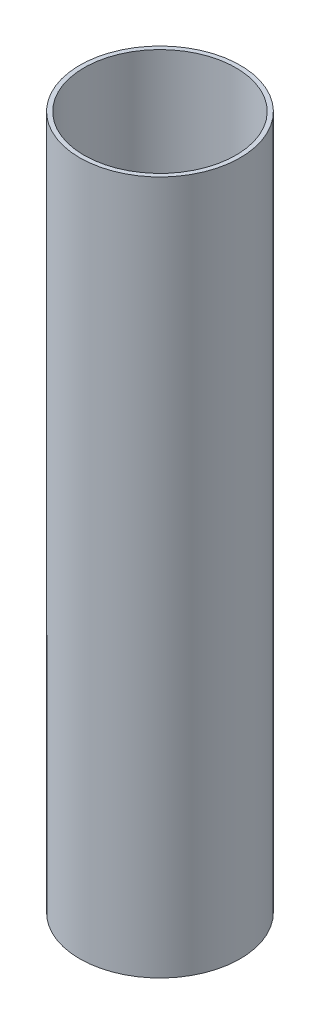
ISO-10303-21;
HEADER;
FILE_DESCRIPTION(('STEP AP214'),'2;1');
FILE_NAME('part.step','',(''),(''),'','','');
FILE_SCHEMA(('AUTOMOTIVE_DESIGN { 1 0 10303 214 1 1 1 1 }'));
ENDSEC;
DATA;
#1=APPLICATION_CONTEXT('core data for automotive mechanical design processes');
#2=APPLICATION_PROTOCOL_DEFINITION('international standard','automotive_design',2000,#1);
#3=PRODUCT_CONTEXT('',#1,'mechanical');
#4=PRODUCT('Part','Part','',(#3));
#5=PRODUCT_RELATED_PRODUCT_CATEGORY('part','',(#4));
#6=PRODUCT_DEFINITION_FORMATION('','',#4);
#7=PRODUCT_DEFINITION_CONTEXT('part definition',#1,'design');
#8=PRODUCT_DEFINITION('design','',#6,#7);
#9=PRODUCT_DEFINITION_SHAPE('','',#8);
#10=(LENGTH_UNIT() NAMED_UNIT(*) SI_UNIT(.MILLI.,.METRE.));
#11=(NAMED_UNIT(*) PLANE_ANGLE_UNIT() SI_UNIT($,.RADIAN.));
#12=(NAMED_UNIT(*) SI_UNIT($,.STERADIAN.) SOLID_ANGLE_UNIT());
#13=UNCERTAINTY_MEASURE_WITH_UNIT(LENGTH_MEASURE(1.E-05),#10,'distance_accuracy_value','');
#14=(GEOMETRIC_REPRESENTATION_CONTEXT(3) GLOBAL_UNCERTAINTY_ASSIGNED_CONTEXT((#13)) GLOBAL_UNIT_ASSIGNED_CONTEXT((#10,
#11,#12)) REPRESENTATION_CONTEXT('',''));
#15=CARTESIAN_POINT('',(0.,0.,0.));
#16=DIRECTION('',(0.,0.,1.));
#17=DIRECTION('',(1.,0.,0.));
#18=AXIS2_PLACEMENT_3D('',#15,#16,#17);
#19=CARTESIAN_POINT('',(0.,508.,0.));
#20=DIRECTION('',(0.,1.,0.));
#21=DIRECTION('',(0.,0.,1.));
#22=AXIS2_PLACEMENT_3D('',#19,#20,#21);
#23=PLANE('',#22);
#24=CARTESIAN_POINT('',(0.,508.,0.));
#25=DIRECTION('',(0.,1.,0.));
#26=DIRECTION('',(0.,0.,1.));
#27=AXIS2_PLACEMENT_3D('',#24,#25,#26);
#28=CIRCLE('',#27,58.7375);
#29=CARTESIAN_POINT('',(0.,508.,58.7375));
#30=VERTEX_POINT('',#29);
#31=EDGE_CURVE('E10',#30,#30,#28,.T.);
#32=ORIENTED_EDGE('',*,*,#31,.T.);
#33=EDGE_LOOP('',(#32));
#34=FACE_BOUND('',#33,.T.);
#35=CARTESIAN_POINT('',(0.,508.,0.));
#36=DIRECTION('',(0.,1.,0.));
#37=DIRECTION('',(0.,0.,1.));
#38=AXIS2_PLACEMENT_3D('',#35,#36,#37);
#39=CIRCLE('',#38,55.5625);
#40=CARTESIAN_POINT('',(0.,508.,55.5625));
#41=VERTEX_POINT('',#40);
#42=EDGE_CURVE('E50',#41,#41,#39,.T.);
#43=ORIENTED_EDGE('',*,*,#42,.F.);
#44=EDGE_LOOP('',(#43));
#45=FACE_BOUND('',#44,.T.);
#46=ADVANCED_FACE('F37',(#34,#45),#23,.T.);
#47=CARTESIAN_POINT('',(0.,0.,0.));
#48=DIRECTION('',(0.,1.,0.));
#49=DIRECTION('',(0.,0.,1.));
#50=AXIS2_PLACEMENT_3D('',#47,#48,#49);
#51=PLANE('',#50);
#52=CARTESIAN_POINT('',(0.,0.,0.));
#53=DIRECTION('',(0.,1.,0.));
#54=DIRECTION('',(0.,0.,1.));
#55=AXIS2_PLACEMENT_3D('',#52,#53,#54);
#56=CIRCLE('',#55,58.7375);
#57=CARTESIAN_POINT('',(0.,0.,58.7375));
#58=VERTEX_POINT('',#57);
#59=EDGE_CURVE('E41',#58,#58,#56,.T.);
#60=ORIENTED_EDGE('',*,*,#59,.F.);
#61=EDGE_LOOP('',(#60));
#62=FACE_BOUND('',#61,.T.);
#63=CARTESIAN_POINT('',(0.,0.,0.));
#64=DIRECTION('',(0.,1.,0.));
#65=DIRECTION('',(0.,0.,1.));
#66=AXIS2_PLACEMENT_3D('',#63,#64,#65);
#67=CIRCLE('',#66,55.5625);
#68=CARTESIAN_POINT('',(0.,0.,55.5625));
#69=VERTEX_POINT('',#68);
#70=EDGE_CURVE('E52',#69,#69,#67,.T.);
#71=ORIENTED_EDGE('',*,*,#70,.T.);
#72=EDGE_LOOP('',(#71));
#73=FACE_BOUND('',#72,.T.);
#74=ADVANCED_FACE('F64',(#62,#73),#51,.F.);
#75=CARTESIAN_POINT('',(0.,508.,0.));
#76=DIRECTION('',(0.,-1.,0.));
#77=DIRECTION('',(0.,0.,-1.));
#78=AXIS2_PLACEMENT_3D('',#75,#76,#77);
#79=CYLINDRICAL_SURFACE('',#78,58.7375);
#80=ORIENTED_EDGE('',*,*,#31,.F.);
#81=EDGE_LOOP('',(#80));
#82=FACE_BOUND('',#81,.T.);
#83=ORIENTED_EDGE('',*,*,#59,.T.);
#84=EDGE_LOOP('',(#83));
#85=FACE_BOUND('',#84,.T.);
#86=ADVANCED_FACE('F39',(#82,#85),#79,.T.);
#87=CARTESIAN_POINT('',(0.,508.,0.));
#88=DIRECTION('',(0.,-1.,0.));
#89=DIRECTION('',(0.,0.,-1.));
#90=AXIS2_PLACEMENT_3D('',#87,#88,#89);
#91=CYLINDRICAL_SURFACE('',#90,55.5625);
#92=ORIENTED_EDGE('',*,*,#42,.T.);
#93=EDGE_LOOP('',(#92));
#94=FACE_BOUND('',#93,.T.);
#95=ORIENTED_EDGE('',*,*,#70,.F.);
#96=EDGE_LOOP('',(#95));
#97=FACE_BOUND('',#96,.T.);
#98=ADVANCED_FACE('F60',(#94,#97),#91,.F.);
#99=CLOSED_SHELL('',(#46,#74,#86,#98));
#100=MANIFOLD_SOLID_BREP('B2',#99);
#101=ADVANCED_BREP_SHAPE_REPRESENTATION('',(#18,#100),#14);
#102=SHAPE_DEFINITION_REPRESENTATION(#9,#101);
ENDSEC;
END-ISO-10303-21;
